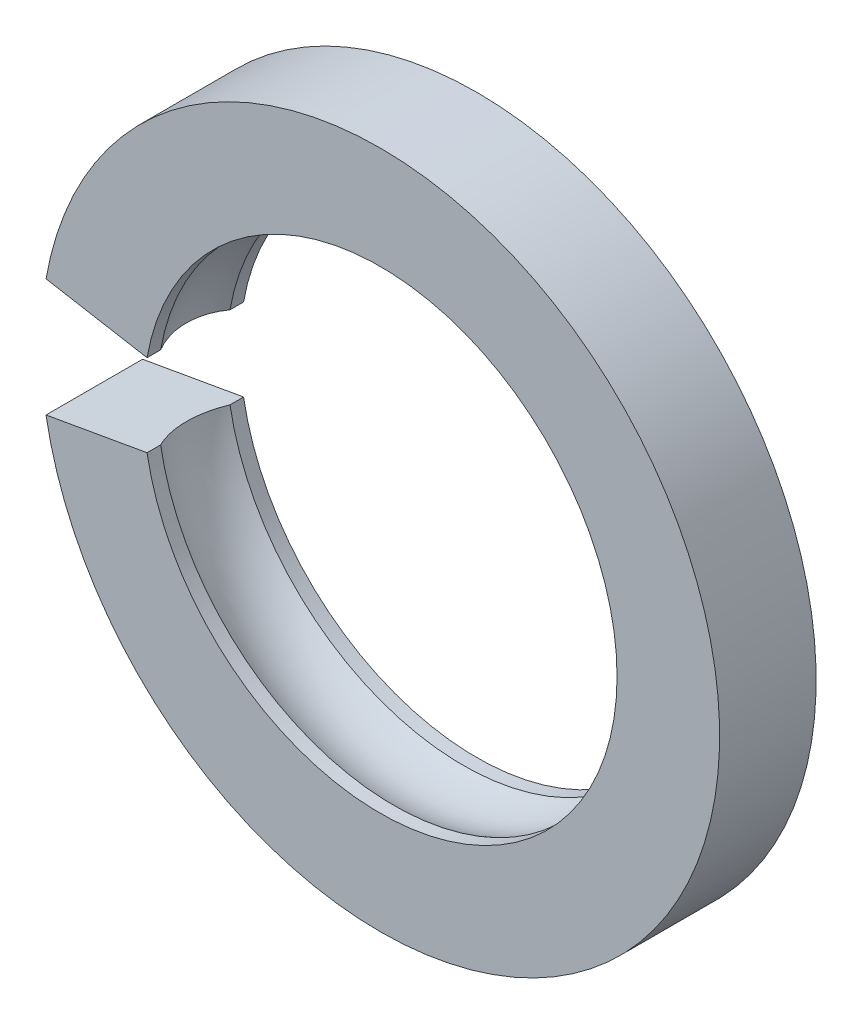
ISO-10303-21;
HEADER;
FILE_DESCRIPTION(('STEP AP214'),'2;1');
FILE_NAME('part.step','',(''),(''),'','','');
FILE_SCHEMA(('AUTOMOTIVE_DESIGN { 1 0 10303 214 1 1 1 1 }'));
ENDSEC;
DATA;
#1=APPLICATION_CONTEXT('core data for automotive mechanical design processes');
#2=APPLICATION_PROTOCOL_DEFINITION('international standard','automotive_design',2000,#1);
#3=PRODUCT_CONTEXT('',#1,'mechanical');
#4=PRODUCT('Part','Part','',(#3));
#5=PRODUCT_RELATED_PRODUCT_CATEGORY('part','',(#4));
#6=PRODUCT_DEFINITION_FORMATION('','',#4);
#7=PRODUCT_DEFINITION_CONTEXT('part definition',#1,'design');
#8=PRODUCT_DEFINITION('design','',#6,#7);
#9=PRODUCT_DEFINITION_SHAPE('','',#8);
#10=(LENGTH_UNIT() NAMED_UNIT(*) SI_UNIT(.MILLI.,.METRE.));
#11=(NAMED_UNIT(*) PLANE_ANGLE_UNIT() SI_UNIT($,.RADIAN.));
#12=(NAMED_UNIT(*) SI_UNIT($,.STERADIAN.) SOLID_ANGLE_UNIT());
#13=UNCERTAINTY_MEASURE_WITH_UNIT(LENGTH_MEASURE(1.E-05),#10,'distance_accuracy_value','');
#14=(GEOMETRIC_REPRESENTATION_CONTEXT(3) GLOBAL_UNCERTAINTY_ASSIGNED_CONTEXT((#13)) GLOBAL_UNIT_ASSIGNED_CONTEXT((#10,
#11,#12)) REPRESENTATION_CONTEXT('',''));
#15=CARTESIAN_POINT('',(0.,0.,0.));
#16=DIRECTION('',(0.,0.,1.));
#17=DIRECTION('',(1.,0.,0.));
#18=AXIS2_PLACEMENT_3D('',#15,#16,#17);
#19=CARTESIAN_POINT('',(0.,0.,6.4));
#20=DIRECTION('',(0.,0.,-1.));
#21=DIRECTION('',(-1.,0.,0.));
#22=AXIS2_PLACEMENT_3D('',#19,#20,#21);
#23=CYLINDRICAL_SURFACE('',#22,15.7);
#24=DIRECTION('',(0.,0.,-1.));
#25=VECTOR('',#24,1.);
#26=CARTESIAN_POINT('',(-15.4614817222912,-2.72627638937356,6.4));
#27=LINE('',#26,#25);
#28=CARTESIAN_POINT('',(-15.4614817222912,-2.72627638937356,0.));
#29=VERTEX_POINT('',#28);
#30=CARTESIAN_POINT('',(-15.4614817222912,-2.72627638937356,0.900000000000001));
#31=VERTEX_POINT('',#30);
#32=EDGE_CURVE('E41',#29,#31,#27,.F.);
#33=ORIENTED_EDGE('',*,*,#32,.T.);
#34=CARTESIAN_POINT('',(0.,0.,0.900000000000001));
#35=DIRECTION('',(0.,0.,-1.));
#36=DIRECTION('',(-1.,0.,0.));
#37=AXIS2_PLACEMENT_3D('',#34,#35,#36);
#38=CIRCLE('',#37,15.7);
#39=CARTESIAN_POINT('',(-15.4614817222915,2.7262763893718,0.900000000000001));
#40=VERTEX_POINT('',#39);
#41=EDGE_CURVE('E48',#40,#31,#38,.T.);
#42=ORIENTED_EDGE('',*,*,#41,.F.);
#43=DIRECTION('',(0.,0.,-1.));
#44=VECTOR('',#43,1.);
#45=CARTESIAN_POINT('',(-15.4614817222915,2.7262763893718,6.4));
#46=LINE('',#45,#44);
#47=CARTESIAN_POINT('',(-15.4614817222915,2.7262763893718,0.));
#48=VERTEX_POINT('',#47);
#49=EDGE_CURVE('E54',#40,#48,#46,.T.);
#50=ORIENTED_EDGE('',*,*,#49,.T.);
#51=CARTESIAN_POINT('',(0.,0.,0.));
#52=DIRECTION('',(0.,0.,1.));
#53=DIRECTION('',(1.,0.,0.));
#54=AXIS2_PLACEMENT_3D('',#51,#52,#53);
#55=CIRCLE('',#54,15.7);
#56=EDGE_CURVE('E110',#29,#48,#55,.T.);
#57=ORIENTED_EDGE('',*,*,#56,.F.);
#58=EDGE_LOOP('',(#33,#42,#50,#57));
#59=FACE_BOUND('',#58,.T.);
#60=ADVANCED_FACE('F33',(#59),#23,.F.);
#61=CARTESIAN_POINT('',(-15.4614817222915,2.7262763893718,6.4));
#62=VERTEX_POINT('',#61);
#63=CARTESIAN_POINT('',(-15.4614817222915,2.7262763893718,5.5));
#64=VERTEX_POINT('',#63);
#65=EDGE_CURVE('E94',#62,#64,#46,.T.);
#66=ORIENTED_EDGE('',*,*,#65,.T.);
#67=CARTESIAN_POINT('',(0.,0.,5.5));
#68=DIRECTION('',(0.,0.,-1.));
#69=DIRECTION('',(-1.,0.,0.));
#70=AXIS2_PLACEMENT_3D('',#67,#68,#69);
#71=CIRCLE('',#70,15.7);
#72=CARTESIAN_POINT('',(-15.4614817222912,-2.72627638937356,5.5));
#73=VERTEX_POINT('',#72);
#74=EDGE_CURVE('E84',#64,#73,#71,.T.);
#75=ORIENTED_EDGE('',*,*,#74,.T.);
#76=CARTESIAN_POINT('',(-15.4614817222912,-2.72627638937356,6.4));
#77=VERTEX_POINT('',#76);
#78=EDGE_CURVE('E102',#73,#77,#27,.F.);
#79=ORIENTED_EDGE('',*,*,#78,.T.);
#80=CARTESIAN_POINT('',(0.,0.,6.4));
#81=DIRECTION('',(0.,0.,1.));
#82=DIRECTION('',(1.,0.,0.));
#83=AXIS2_PLACEMENT_3D('',#80,#81,#82);
#84=CIRCLE('',#83,15.7);
#85=EDGE_CURVE('E101',#77,#62,#84,.T.);
#86=ORIENTED_EDGE('',*,*,#85,.T.);
#87=EDGE_LOOP('',(#66,#75,#79,#86));
#88=FACE_BOUND('',#87,.T.);
#89=ADVANCED_FACE('F99',(#88),#23,.F.);
#90=CARTESIAN_POINT('',(0.,0.,6.4));
#91=DIRECTION('',(-0.173648177666994,-0.984807753012197,0.));
#92=DIRECTION('',(0.984807753012197,-0.173648177666994,0.));
#93=AXIS2_PLACEMENT_3D('',#90,#91,#92);
#94=PLANE('',#93);
#95=ORIENTED_EDGE('',*,*,#49,.F.);
#96=CARTESIAN_POINT('',(-11.4251170919432,2.01455640106377,3.2));
#97=DIRECTION('',(-0.173648177666994,-0.984807753012197,0.));
#98=DIRECTION('',(0.984807753012197,-0.173648177666994,0.));
#99=AXIS2_PLACEMENT_3D('',#96,#97,#98);
#100=CIRCLE('',#99,4.69987071852878);
#101=EDGE_CURVE('E87',#40,#64,#100,.F.);
#102=ORIENTED_EDGE('',*,*,#101,.T.);
#103=ORIENTED_EDGE('',*,*,#65,.F.);
#104=DIRECTION('',(-0.984807753012197,0.173648177666994,0.));
#105=VECTOR('',#104,1.);
#106=CARTESIAN_POINT('',(0.,0.,6.4));
#107=LINE('',#106,#105);
#108=CARTESIAN_POINT('',(-22.1581744427744,3.90708399750736,6.4));
#109=VERTEX_POINT('',#108);
#110=EDGE_CURVE('E125',#62,#109,#107,.T.);
#111=ORIENTED_EDGE('',*,*,#110,.T.);
#112=DIRECTION('',(0.,0.,-1.));
#113=VECTOR('',#112,1.);
#114=CARTESIAN_POINT('',(-22.1581744427744,3.90708399750736,6.4));
#115=LINE('',#114,#113);
#116=CARTESIAN_POINT('',(-22.1581744427744,3.90708399750736,0.));
#117=VERTEX_POINT('',#116);
#118=EDGE_CURVE('E128',#109,#117,#115,.T.);
#119=ORIENTED_EDGE('',*,*,#118,.T.);
#120=DIRECTION('',(-0.984807753012197,0.173648177666994,0.));
#121=VECTOR('',#120,1.);
#122=CARTESIAN_POINT('',(0.,0.,0.));
#123=LINE('',#122,#121);
#124=EDGE_CURVE('E120',#48,#117,#123,.T.);
#125=ORIENTED_EDGE('',*,*,#124,.F.);
#126=EDGE_LOOP('',(#95,#102,#103,#111,#119,#125));
#127=FACE_BOUND('',#126,.T.);
#128=ADVANCED_FACE('F93',(#127),#94,.T.);
#129=CARTESIAN_POINT('',(0.,0.,6.4));
#130=DIRECTION('',(-0.173648177667106,0.984807753012177,0.));
#131=DIRECTION('',(-0.984807753012177,-0.173648177667106,0.));
#132=AXIS2_PLACEMENT_3D('',#129,#130,#131);
#133=PLANE('',#132);
#134=ORIENTED_EDGE('',*,*,#78,.F.);
#135=CARTESIAN_POINT('',(-11.4251170919429,-2.01455640106507,3.2));
#136=DIRECTION('',(-0.173648177667106,0.984807753012177,0.));
#137=DIRECTION('',(-0.984807753012177,-0.173648177667106,0.));
#138=AXIS2_PLACEMENT_3D('',#135,#136,#137);
#139=CIRCLE('',#138,4.69987071852878);
#140=EDGE_CURVE('E11',#73,#31,#139,.F.);
#141=ORIENTED_EDGE('',*,*,#140,.T.);
#142=ORIENTED_EDGE('',*,*,#32,.F.);
#143=DIRECTION('',(0.984807753012177,0.173648177667106,0.));
#144=VECTOR('',#143,1.);
#145=CARTESIAN_POINT('',(0.,0.,0.));
#146=LINE('',#145,#144);
#147=CARTESIAN_POINT('',(-22.158174442774,-3.90708399750988,0.));
#148=VERTEX_POINT('',#147);
#149=EDGE_CURVE('E96',#148,#29,#146,.T.);
#150=ORIENTED_EDGE('',*,*,#149,.F.);
#151=DIRECTION('',(0.,0.,-1.));
#152=VECTOR('',#151,1.);
#153=CARTESIAN_POINT('',(-22.158174442774,-3.90708399750988,6.4));
#154=LINE('',#153,#152);
#155=CARTESIAN_POINT('',(-22.158174442774,-3.90708399750988,6.4));
#156=VERTEX_POINT('',#155);
#157=EDGE_CURVE('E130',#148,#156,#154,.F.);
#158=ORIENTED_EDGE('',*,*,#157,.T.);
#159=DIRECTION('',(0.984807753012177,0.173648177667106,0.));
#160=VECTOR('',#159,1.);
#161=CARTESIAN_POINT('',(0.,0.,6.4));
#162=LINE('',#161,#160);
#163=EDGE_CURVE('E122',#156,#77,#162,.T.);
#164=ORIENTED_EDGE('',*,*,#163,.T.);
#165=EDGE_LOOP('',(#134,#141,#142,#150,#158,#164));
#166=FACE_BOUND('',#165,.T.);
#167=ADVANCED_FACE('F113',(#166),#133,.T.);
#168=CARTESIAN_POINT('',(0.,0.,6.4));
#169=DIRECTION('',(0.,0.,1.));
#170=DIRECTION('',(1.,0.,0.));
#171=AXIS2_PLACEMENT_3D('',#168,#169,#170);
#172=PLANE('',#171);
#173=ORIENTED_EDGE('',*,*,#85,.F.);
#174=ORIENTED_EDGE('',*,*,#163,.F.);
#175=CARTESIAN_POINT('',(0.,0.,6.4));
#176=DIRECTION('',(0.,0.,1.));
#177=DIRECTION('',(1.,0.,0.));
#178=AXIS2_PLACEMENT_3D('',#175,#176,#177);
#179=CIRCLE('',#178,22.5);
#180=EDGE_CURVE('E104',#156,#109,#179,.T.);
#181=ORIENTED_EDGE('',*,*,#180,.T.);
#182=ORIENTED_EDGE('',*,*,#110,.F.);
#183=EDGE_LOOP('',(#173,#174,#181,#182));
#184=FACE_BOUND('',#183,.T.);
#185=ADVANCED_FACE('F140',(#184),#172,.T.);
#186=CARTESIAN_POINT('',(0.,0.,0.));
#187=DIRECTION('',(0.,0.,1.));
#188=DIRECTION('',(1.,0.,0.));
#189=AXIS2_PLACEMENT_3D('',#186,#187,#188);
#190=PLANE('',#189);
#191=ORIENTED_EDGE('',*,*,#149,.T.);
#192=ORIENTED_EDGE('',*,*,#56,.T.);
#193=ORIENTED_EDGE('',*,*,#124,.T.);
#194=CARTESIAN_POINT('',(0.,0.,0.));
#195=DIRECTION('',(0.,0.,1.));
#196=DIRECTION('',(1.,0.,0.));
#197=AXIS2_PLACEMENT_3D('',#194,#195,#196);
#198=CIRCLE('',#197,22.5);
#199=EDGE_CURVE('E106',#148,#117,#198,.T.);
#200=ORIENTED_EDGE('',*,*,#199,.F.);
#201=EDGE_LOOP('',(#191,#192,#193,#200));
#202=FACE_BOUND('',#201,.T.);
#203=ADVANCED_FACE('F117',(#202),#190,.F.);
#204=CARTESIAN_POINT('',(0.,0.,6.4));
#205=DIRECTION('',(0.,0.,-1.));
#206=DIRECTION('',(-1.,0.,0.));
#207=AXIS2_PLACEMENT_3D('',#204,#205,#206);
#208=CYLINDRICAL_SURFACE('',#207,22.5);
#209=ORIENTED_EDGE('',*,*,#157,.F.);
#210=ORIENTED_EDGE('',*,*,#199,.T.);
#211=ORIENTED_EDGE('',*,*,#118,.F.);
#212=ORIENTED_EDGE('',*,*,#180,.F.);
#213=EDGE_LOOP('',(#209,#210,#211,#212));
#214=FACE_BOUND('',#213,.T.);
#215=ADVANCED_FACE('F35',(#214),#208,.T.);
#216=CARTESIAN_POINT('',(0.,0.,3.2));
#217=DIRECTION('',(0.,0.,-1.));
#218=DIRECTION('',(-1.,0.,0.));
#219=AXIS2_PLACEMENT_3D('',#216,#217,#218);
#220=TOROIDAL_SURFACE('',#219,11.6013679390699,4.69987071852878);
#221=ORIENTED_EDGE('',*,*,#41,.T.);
#222=ORIENTED_EDGE('',*,*,#140,.F.);
#223=ORIENTED_EDGE('',*,*,#74,.F.);
#224=ORIENTED_EDGE('',*,*,#101,.F.);
#225=EDGE_LOOP('',(#221,#222,#223,#224));
#226=FACE_BOUND('',#225,.T.);
#227=ADVANCED_FACE('F86',(#226),#220,.F.);
#228=CLOSED_SHELL('',(#60,#89,#128,#167,#185,#203,#215,#227));
#229=MANIFOLD_SOLID_BREP('B2',#228);
#230=ADVANCED_BREP_SHAPE_REPRESENTATION('',(#18,#229),#14);
#231=SHAPE_DEFINITION_REPRESENTATION(#9,#230);
ENDSEC;
END-ISO-10303-21;
